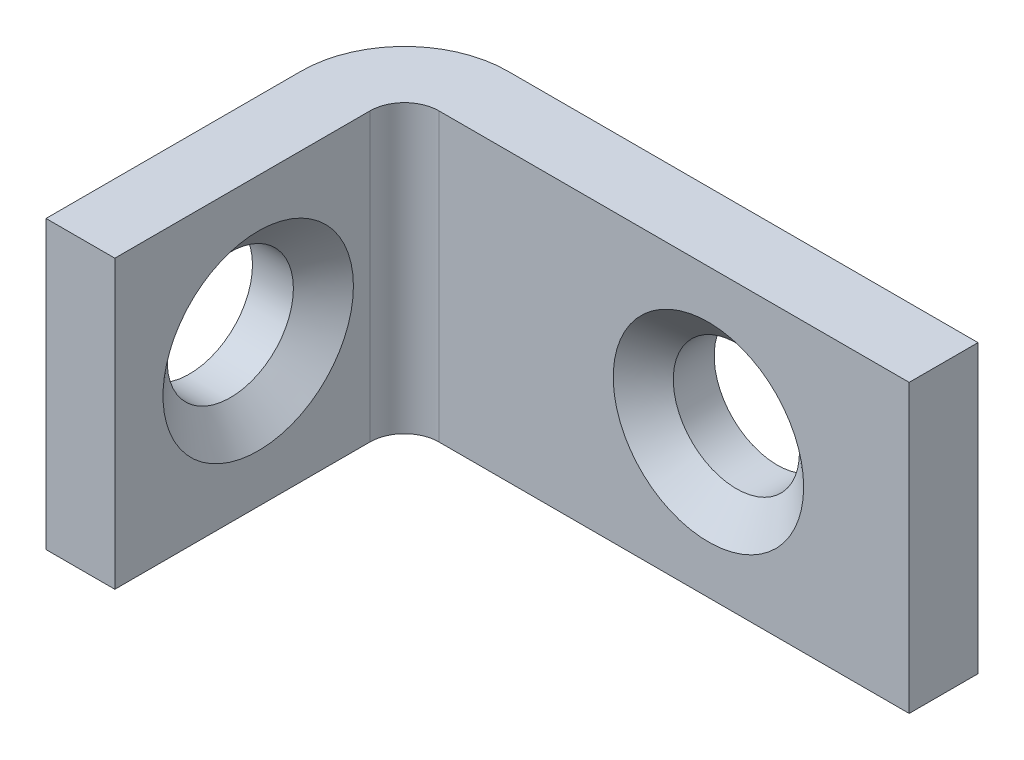
ISO-10303-21;
HEADER;
FILE_DESCRIPTION(('STEP AP214'),'2;1');
FILE_NAME('part.step','',(''),(''),'','','');
FILE_SCHEMA(('AUTOMOTIVE_DESIGN { 1 0 10303 214 1 1 1 1 }'));
ENDSEC;
DATA;
#1=APPLICATION_CONTEXT('core data for automotive mechanical design processes');
#2=APPLICATION_PROTOCOL_DEFINITION('international standard','automotive_design',2000,#1);
#3=PRODUCT_CONTEXT('',#1,'mechanical');
#4=PRODUCT('Part','Part','',(#3));
#5=PRODUCT_RELATED_PRODUCT_CATEGORY('part','',(#4));
#6=PRODUCT_DEFINITION_FORMATION('','',#4);
#7=PRODUCT_DEFINITION_CONTEXT('part definition',#1,'design');
#8=PRODUCT_DEFINITION('design','',#6,#7);
#9=PRODUCT_DEFINITION_SHAPE('','',#8);
#10=(LENGTH_UNIT() NAMED_UNIT(*) SI_UNIT(.MILLI.,.METRE.));
#11=(NAMED_UNIT(*) PLANE_ANGLE_UNIT() SI_UNIT($,.RADIAN.));
#12=(NAMED_UNIT(*) SI_UNIT($,.STERADIAN.) SOLID_ANGLE_UNIT());
#13=UNCERTAINTY_MEASURE_WITH_UNIT(LENGTH_MEASURE(1.E-05),#10,'distance_accuracy_value','');
#14=(GEOMETRIC_REPRESENTATION_CONTEXT(3) GLOBAL_UNCERTAINTY_ASSIGNED_CONTEXT((#13)) GLOBAL_UNIT_ASSIGNED_CONTEXT((#10,
#11,#12)) REPRESENTATION_CONTEXT('',''));
#15=CARTESIAN_POINT('',(0.,0.,0.));
#16=DIRECTION('',(0.,0.,1.));
#17=DIRECTION('',(1.,0.,0.));
#18=AXIS2_PLACEMENT_3D('',#15,#16,#17);
#19=CARTESIAN_POINT('',(4.572,6.35,3.048));
#20=DIRECTION('',(0.,0.,-1.));
#21=DIRECTION('',(-1.,0.,0.));
#22=AXIS2_PLACEMENT_3D('',#19,#20,#21);
#23=PLANE('',#22);
#24=CARTESIAN_POINT('',(16.51,0.,3.048));
#25=DIRECTION('',(0.,0.,1.));
#26=DIRECTION('',(1.,0.,0.));
#27=AXIS2_PLACEMENT_3D('',#24,#25,#26);
#28=CIRCLE('',#27,4.2164);
#29=CARTESIAN_POINT('',(20.7264,0.,3.048));
#30=VERTEX_POINT('',#29);
#31=EDGE_CURVE('E184',#30,#30,#28,.T.);
#32=ORIENTED_EDGE('',*,*,#31,.F.);
#33=EDGE_LOOP('',(#32));
#34=FACE_BOUND('',#33,.T.);
#35=DIRECTION('',(1.,0.,0.));
#36=VECTOR('',#35,1.);
#37=CARTESIAN_POINT('',(4.572,-6.35,3.048));
#38=LINE('',#37,#36);
#39=CARTESIAN_POINT('',(4.572,-6.35,3.048));
#40=VERTEX_POINT('',#39);
#41=CARTESIAN_POINT('',(25.4,-6.35,3.048));
#42=VERTEX_POINT('',#41);
#43=EDGE_CURVE('E145',#40,#42,#38,.T.);
#44=ORIENTED_EDGE('',*,*,#43,.T.);
#45=DIRECTION('',(0.,-1.,0.));
#46=VECTOR('',#45,1.);
#47=CARTESIAN_POINT('',(25.4,6.35,3.048));
#48=LINE('',#47,#46);
#49=CARTESIAN_POINT('',(25.4,6.35,3.048));
#50=VERTEX_POINT('',#49);
#51=EDGE_CURVE('E13',#50,#42,#48,.T.);
#52=ORIENTED_EDGE('',*,*,#51,.F.);
#53=DIRECTION('',(1.,0.,0.));
#54=VECTOR('',#53,1.);
#55=CARTESIAN_POINT('',(4.572,6.35,3.048));
#56=LINE('',#55,#54);
#57=CARTESIAN_POINT('',(4.572,6.35,3.048));
#58=VERTEX_POINT('',#57);
#59=EDGE_CURVE('E103',#58,#50,#56,.T.);
#60=ORIENTED_EDGE('',*,*,#59,.F.);
#61=DIRECTION('',(0.,-1.,0.));
#62=VECTOR('',#61,1.);
#63=CARTESIAN_POINT('',(4.572,6.35,3.048));
#64=LINE('',#63,#62);
#65=EDGE_CURVE('E144',#58,#40,#64,.T.);
#66=ORIENTED_EDGE('',*,*,#65,.T.);
#67=EDGE_LOOP('',(#44,#52,#60,#66));
#68=FACE_BOUND('',#67,.T.);
#69=ADVANCED_FACE('F46',(#34,#68),#23,.F.);
#70=CARTESIAN_POINT('',(4.572,6.35,0.));
#71=DIRECTION('',(0.,0.,-1.));
#72=DIRECTION('',(-1.,0.,0.));
#73=AXIS2_PLACEMENT_3D('',#70,#71,#72);
#74=PLANE('',#73);
#75=DIRECTION('',(1.,0.,0.));
#76=VECTOR('',#75,1.);
#77=CARTESIAN_POINT('',(4.572,-6.35,0.));
#78=LINE('',#77,#76);
#79=CARTESIAN_POINT('',(4.572,-6.35,0.));
#80=VERTEX_POINT('',#79);
#81=CARTESIAN_POINT('',(25.4,-6.35,0.));
#82=VERTEX_POINT('',#81);
#83=EDGE_CURVE('E152',#80,#82,#78,.T.);
#84=ORIENTED_EDGE('',*,*,#83,.F.);
#85=DIRECTION('',(0.,-1.,0.));
#86=VECTOR('',#85,1.);
#87=CARTESIAN_POINT('',(4.572,6.35,0.));
#88=LINE('',#87,#86);
#89=CARTESIAN_POINT('',(4.572,6.35,0.));
#90=VERTEX_POINT('',#89);
#91=EDGE_CURVE('E169',#90,#80,#88,.T.);
#92=ORIENTED_EDGE('',*,*,#91,.F.);
#93=DIRECTION('',(1.,0.,0.));
#94=VECTOR('',#93,1.);
#95=CARTESIAN_POINT('',(4.572,6.35,0.));
#96=LINE('',#95,#94);
#97=CARTESIAN_POINT('',(25.4,6.35,0.));
#98=VERTEX_POINT('',#97);
#99=EDGE_CURVE('E193',#90,#98,#96,.T.);
#100=ORIENTED_EDGE('',*,*,#99,.T.);
#101=DIRECTION('',(0.,-1.,0.));
#102=VECTOR('',#101,1.);
#103=CARTESIAN_POINT('',(25.4,6.35,0.));
#104=LINE('',#103,#102);
#105=EDGE_CURVE('E55',#98,#82,#104,.T.);
#106=ORIENTED_EDGE('',*,*,#105,.T.);
#107=EDGE_LOOP('',(#84,#92,#100,#106));
#108=FACE_BOUND('',#107,.T.);
#109=CARTESIAN_POINT('',(16.51,0.,0.));
#110=DIRECTION('',(0.,0.,1.));
#111=DIRECTION('',(1.,0.,0.));
#112=AXIS2_PLACEMENT_3D('',#109,#110,#111);
#113=CIRCLE('',#112,2.794);
#114=CARTESIAN_POINT('',(19.304,0.,0.));
#115=VERTEX_POINT('',#114);
#116=EDGE_CURVE('E173',#115,#115,#113,.T.);
#117=ORIENTED_EDGE('',*,*,#116,.T.);
#118=EDGE_LOOP('',(#117));
#119=FACE_BOUND('',#118,.T.);
#120=ADVANCED_FACE('F221',(#108,#119),#74,.T.);
#121=CARTESIAN_POINT('',(25.4,6.35,0.));
#122=DIRECTION('',(1.,0.,0.));
#123=DIRECTION('',(0.,0.,-1.));
#124=AXIS2_PLACEMENT_3D('',#121,#122,#123);
#125=PLANE('',#124);
#126=DIRECTION('',(0.,0.,1.));
#127=VECTOR('',#126,1.);
#128=CARTESIAN_POINT('',(25.4,-6.35,0.));
#129=LINE('',#128,#127);
#130=EDGE_CURVE('E148',#82,#42,#129,.T.);
#131=ORIENTED_EDGE('',*,*,#130,.F.);
#132=ORIENTED_EDGE('',*,*,#105,.F.);
#133=DIRECTION('',(0.,0.,1.));
#134=VECTOR('',#133,1.);
#135=CARTESIAN_POINT('',(25.4,6.35,0.));
#136=LINE('',#135,#134);
#137=EDGE_CURVE('E190',#98,#50,#136,.T.);
#138=ORIENTED_EDGE('',*,*,#137,.T.);
#139=ORIENTED_EDGE('',*,*,#51,.T.);
#140=EDGE_LOOP('',(#131,#132,#138,#139));
#141=FACE_BOUND('',#140,.T.);
#142=ADVANCED_FACE('F226',(#141),#125,.T.);
#143=CARTESIAN_POINT('',(4.572,6.35,4.572));
#144=DIRECTION('',(0.,-1.,0.));
#145=DIRECTION('',(0.,0.,-1.));
#146=AXIS2_PLACEMENT_3D('',#143,#144,#145);
#147=CYLINDRICAL_SURFACE('',#146,4.572);
#148=CARTESIAN_POINT('',(4.572,-6.35,4.572));
#149=DIRECTION('',(0.,-1.,0.));
#150=DIRECTION('',(0.,0.,1.));
#151=AXIS2_PLACEMENT_3D('',#148,#149,#150);
#152=CIRCLE('',#151,4.572);
#153=CARTESIAN_POINT('',(0.,-6.35,4.572));
#154=VERTEX_POINT('',#153);
#155=EDGE_CURVE('E155',#154,#80,#152,.T.);
#156=ORIENTED_EDGE('',*,*,#155,.F.);
#157=DIRECTION('',(0.,-1.,0.));
#158=VECTOR('',#157,1.);
#159=CARTESIAN_POINT('',(0.,6.35,4.572));
#160=LINE('',#159,#158);
#161=CARTESIAN_POINT('',(0.,6.35,4.572));
#162=VERTEX_POINT('',#161);
#163=EDGE_CURVE('E167',#162,#154,#160,.T.);
#164=ORIENTED_EDGE('',*,*,#163,.F.);
#165=CARTESIAN_POINT('',(4.572,6.35,4.572));
#166=DIRECTION('',(0.,-1.,0.));
#167=DIRECTION('',(0.,0.,1.));
#168=AXIS2_PLACEMENT_3D('',#165,#166,#167);
#169=CIRCLE('',#168,4.572);
#170=EDGE_CURVE('E139',#162,#90,#169,.T.);
#171=ORIENTED_EDGE('',*,*,#170,.T.);
#172=ORIENTED_EDGE('',*,*,#91,.T.);
#173=EDGE_LOOP('',(#156,#164,#171,#172));
#174=FACE_BOUND('',#173,.T.);
#175=ADVANCED_FACE('F198',(#174),#147,.T.);
#176=CARTESIAN_POINT('',(0.,6.35,15.875));
#177=DIRECTION('',(-1.,0.,0.));
#178=DIRECTION('',(0.,0.,1.));
#179=AXIS2_PLACEMENT_3D('',#176,#177,#178);
#180=PLANE('',#179);
#181=CARTESIAN_POINT('',(0.,0.,9.525));
#182=DIRECTION('',(1.,0.,0.));
#183=DIRECTION('',(0.,0.,-1.));
#184=AXIS2_PLACEMENT_3D('',#181,#182,#183);
#185=CIRCLE('',#184,2.794);
#186=CARTESIAN_POINT('',(0.,0.,6.731));
#187=VERTEX_POINT('',#186);
#188=EDGE_CURVE('E149',#187,#187,#185,.T.);
#189=ORIENTED_EDGE('',*,*,#188,.T.);
#190=EDGE_LOOP('',(#189));
#191=FACE_BOUND('',#190,.T.);
#192=DIRECTION('',(0.,0.,-1.));
#193=VECTOR('',#192,1.);
#194=CARTESIAN_POINT('',(0.,-6.35,15.875));
#195=LINE('',#194,#193);
#196=CARTESIAN_POINT('',(0.,-6.35,15.875));
#197=VERTEX_POINT('',#196);
#198=EDGE_CURVE('E158',#197,#154,#195,.T.);
#199=ORIENTED_EDGE('',*,*,#198,.F.);
#200=DIRECTION('',(0.,-1.,0.));
#201=VECTOR('',#200,1.);
#202=CARTESIAN_POINT('',(0.,6.35,15.875));
#203=LINE('',#202,#201);
#204=CARTESIAN_POINT('',(0.,6.35,15.875));
#205=VERTEX_POINT('',#204);
#206=EDGE_CURVE('E127',#205,#197,#203,.T.);
#207=ORIENTED_EDGE('',*,*,#206,.F.);
#208=DIRECTION('',(0.,0.,-1.));
#209=VECTOR('',#208,1.);
#210=CARTESIAN_POINT('',(0.,6.35,15.875));
#211=LINE('',#210,#209);
#212=EDGE_CURVE('E137',#205,#162,#211,.T.);
#213=ORIENTED_EDGE('',*,*,#212,.T.);
#214=ORIENTED_EDGE('',*,*,#163,.T.);
#215=EDGE_LOOP('',(#199,#207,#213,#214));
#216=FACE_BOUND('',#215,.T.);
#217=ADVANCED_FACE('F203',(#191,#216),#180,.T.);
#218=CARTESIAN_POINT('',(3.048,6.35,15.875));
#219=DIRECTION('',(0.,0.,1.));
#220=DIRECTION('',(1.,0.,0.));
#221=AXIS2_PLACEMENT_3D('',#218,#219,#220);
#222=PLANE('',#221);
#223=DIRECTION('',(-1.,0.,0.));
#224=VECTOR('',#223,1.);
#225=CARTESIAN_POINT('',(3.048,-6.35,15.875));
#226=LINE('',#225,#224);
#227=CARTESIAN_POINT('',(3.048,-6.35,15.875));
#228=VERTEX_POINT('',#227);
#229=EDGE_CURVE('E126',#228,#197,#226,.T.);
#230=ORIENTED_EDGE('',*,*,#229,.F.);
#231=DIRECTION('',(0.,-1.,0.));
#232=VECTOR('',#231,1.);
#233=CARTESIAN_POINT('',(3.048,6.35,15.875));
#234=LINE('',#233,#232);
#235=CARTESIAN_POINT('',(3.048,6.35,15.875));
#236=VERTEX_POINT('',#235);
#237=EDGE_CURVE('E120',#236,#228,#234,.T.);
#238=ORIENTED_EDGE('',*,*,#237,.F.);
#239=DIRECTION('',(-1.,0.,0.));
#240=VECTOR('',#239,1.);
#241=CARTESIAN_POINT('',(3.048,6.35,15.875));
#242=LINE('',#241,#240);
#243=EDGE_CURVE('E124',#236,#205,#242,.T.);
#244=ORIENTED_EDGE('',*,*,#243,.T.);
#245=ORIENTED_EDGE('',*,*,#206,.T.);
#246=EDGE_LOOP('',(#230,#238,#244,#245));
#247=FACE_BOUND('',#246,.T.);
#248=ADVANCED_FACE('F122',(#247),#222,.T.);
#249=CARTESIAN_POINT('',(3.048,6.35,15.875));
#250=DIRECTION('',(-1.,0.,0.));
#251=DIRECTION('',(0.,0.,1.));
#252=AXIS2_PLACEMENT_3D('',#249,#250,#251);
#253=PLANE('',#252);
#254=CARTESIAN_POINT('',(3.048,0.,9.525));
#255=DIRECTION('',(1.,0.,0.));
#256=DIRECTION('',(0.,0.,-1.));
#257=AXIS2_PLACEMENT_3D('',#254,#255,#256);
#258=CIRCLE('',#257,4.2164);
#259=CARTESIAN_POINT('',(3.048,0.,5.3086));
#260=VERTEX_POINT('',#259);
#261=EDGE_CURVE('E174',#260,#260,#258,.T.);
#262=ORIENTED_EDGE('',*,*,#261,.F.);
#263=EDGE_LOOP('',(#262));
#264=FACE_BOUND('',#263,.T.);
#265=DIRECTION('',(0.,0.,-1.));
#266=VECTOR('',#265,1.);
#267=CARTESIAN_POINT('',(3.048,-6.35,15.875));
#268=LINE('',#267,#266);
#269=CARTESIAN_POINT('',(3.048,-6.35,4.572));
#270=VERTEX_POINT('',#269);
#271=EDGE_CURVE('E91',#228,#270,#268,.T.);
#272=ORIENTED_EDGE('',*,*,#271,.T.);
#273=DIRECTION('',(0.,-1.,0.));
#274=VECTOR('',#273,1.);
#275=CARTESIAN_POINT('',(3.048,6.35,4.572));
#276=LINE('',#275,#274);
#277=CARTESIAN_POINT('',(3.048,6.35,4.572));
#278=VERTEX_POINT('',#277);
#279=EDGE_CURVE('E128',#278,#270,#276,.T.);
#280=ORIENTED_EDGE('',*,*,#279,.F.);
#281=DIRECTION('',(0.,0.,-1.));
#282=VECTOR('',#281,1.);
#283=CARTESIAN_POINT('',(3.048,6.35,15.875));
#284=LINE('',#283,#282);
#285=EDGE_CURVE('E130',#236,#278,#284,.T.);
#286=ORIENTED_EDGE('',*,*,#285,.F.);
#287=ORIENTED_EDGE('',*,*,#237,.T.);
#288=EDGE_LOOP('',(#272,#280,#286,#287));
#289=FACE_BOUND('',#288,.T.);
#290=ADVANCED_FACE('F131',(#264,#289),#253,.F.);
#291=CARTESIAN_POINT('',(4.572,6.35,4.572));
#292=DIRECTION('',(0.,-1.,0.));
#293=DIRECTION('',(0.,0.,-1.));
#294=AXIS2_PLACEMENT_3D('',#291,#292,#293);
#295=CYLINDRICAL_SURFACE('',#294,1.524);
#296=CARTESIAN_POINT('',(4.572,-6.35,4.572));
#297=DIRECTION('',(0.,1.,0.));
#298=DIRECTION('',(1.,0.,0.));
#299=AXIS2_PLACEMENT_3D('',#296,#297,#298);
#300=CIRCLE('',#299,1.524);
#301=EDGE_CURVE('E97',#270,#40,#300,.F.);
#302=ORIENTED_EDGE('',*,*,#301,.T.);
#303=ORIENTED_EDGE('',*,*,#65,.F.);
#304=CARTESIAN_POINT('',(4.572,6.35,4.572));
#305=DIRECTION('',(0.,1.,0.));
#306=DIRECTION('',(1.,0.,0.));
#307=AXIS2_PLACEMENT_3D('',#304,#305,#306);
#308=CIRCLE('',#307,1.524);
#309=EDGE_CURVE('E64',#278,#58,#308,.F.);
#310=ORIENTED_EDGE('',*,*,#309,.F.);
#311=ORIENTED_EDGE('',*,*,#279,.T.);
#312=EDGE_LOOP('',(#302,#303,#310,#311));
#313=FACE_BOUND('',#312,.T.);
#314=ADVANCED_FACE('F209',(#313),#295,.F.);
#315=CARTESIAN_POINT('',(4.572,6.35,4.572));
#316=DIRECTION('',(0.,-1.,0.));
#317=DIRECTION('',(-1.,0.,0.));
#318=AXIS2_PLACEMENT_3D('',#315,#316,#317);
#319=PLANE('',#318);
#320=ORIENTED_EDGE('',*,*,#59,.T.);
#321=ORIENTED_EDGE('',*,*,#137,.F.);
#322=ORIENTED_EDGE('',*,*,#99,.F.);
#323=ORIENTED_EDGE('',*,*,#170,.F.);
#324=ORIENTED_EDGE('',*,*,#212,.F.);
#325=ORIENTED_EDGE('',*,*,#243,.F.);
#326=ORIENTED_EDGE('',*,*,#285,.T.);
#327=ORIENTED_EDGE('',*,*,#309,.T.);
#328=EDGE_LOOP('',(#320,#321,#322,#323,#324,#325,#326,#327));
#329=FACE_BOUND('',#328,.T.);
#330=ADVANCED_FACE('F134',(#329),#319,.F.);
#331=CARTESIAN_POINT('',(4.572,-6.35,4.572));
#332=DIRECTION('',(0.,-1.,0.));
#333=DIRECTION('',(-1.,0.,0.));
#334=AXIS2_PLACEMENT_3D('',#331,#332,#333);
#335=PLANE('',#334);
#336=ORIENTED_EDGE('',*,*,#43,.F.);
#337=ORIENTED_EDGE('',*,*,#301,.F.);
#338=ORIENTED_EDGE('',*,*,#271,.F.);
#339=ORIENTED_EDGE('',*,*,#229,.T.);
#340=ORIENTED_EDGE('',*,*,#198,.T.);
#341=ORIENTED_EDGE('',*,*,#155,.T.);
#342=ORIENTED_EDGE('',*,*,#83,.T.);
#343=ORIENTED_EDGE('',*,*,#130,.T.);
#344=EDGE_LOOP('',(#336,#337,#338,#339,#340,#341,#342,#343));
#345=FACE_BOUND('',#344,.T.);
#346=ADVANCED_FACE('F206',(#345),#335,.T.);
#347=CARTESIAN_POINT('',(0.,0.,9.525));
#348=DIRECTION('',(1.,0.,0.));
#349=DIRECTION('',(0.,0.,-1.));
#350=AXIS2_PLACEMENT_3D('',#347,#348,#349);
#351=CYLINDRICAL_SURFACE('',#350,2.794);
#352=CARTESIAN_POINT('',(1.8115265441302,0.,9.525));
#353=DIRECTION('',(1.,0.,0.));
#354=DIRECTION('',(0.,0.,-1.));
#355=AXIS2_PLACEMENT_3D('',#352,#353,#354);
#356=CIRCLE('',#355,2.794);
#357=CARTESIAN_POINT('',(1.8115265441302,0.,6.731));
#358=VERTEX_POINT('',#357);
#359=EDGE_CURVE('E171',#358,#358,#356,.T.);
#360=CARTESIAN_POINT('',(1.8115265441302,0.,6.731));
#361=CARTESIAN_POINT('',(1.79265647596218,0.,6.731));
#362=CARTESIAN_POINT('',(1.77378640779416,0.,6.731));
#363=CARTESIAN_POINT('',(1.73604627145811,0.,6.731));
#364=CARTESIAN_POINT('',(1.71717620329009,0.,6.731));
#365=CARTESIAN_POINT('',(1.67943606695404,0.,6.731));
#366=CARTESIAN_POINT('',(1.66056599878602,0.,6.731));
#367=CARTESIAN_POINT('',(1.62282586244997,0.,6.731));
#368=CARTESIAN_POINT('',(1.60395579428195,0.,6.731));
#369=CARTESIAN_POINT('',(1.56621565794591,0.,6.731));
#370=CARTESIAN_POINT('',(1.54734558977788,0.,6.731));
#371=CARTESIAN_POINT('',(1.50960545344184,0.,6.731));
#372=CARTESIAN_POINT('',(1.49073538527381,0.,6.731));
#373=CARTESIAN_POINT('',(1.45299524893777,0.,6.731));
#374=CARTESIAN_POINT('',(1.43412518076974,0.,6.731));
#375=CARTESIAN_POINT('',(1.3963850444337,0.,6.731));
#376=CARTESIAN_POINT('',(1.37751497626568,0.,6.731));
#377=CARTESIAN_POINT('',(1.33977483992963,0.,6.731));
#378=CARTESIAN_POINT('',(1.32090477176161,0.,6.731));
#379=CARTESIAN_POINT('',(1.28316463542556,0.,6.731));
#380=CARTESIAN_POINT('',(1.26429456725754,0.,6.731));
#381=CARTESIAN_POINT('',(1.22655443092149,0.,6.731));
#382=CARTESIAN_POINT('',(1.20768436275347,0.,6.731));
#383=CARTESIAN_POINT('',(1.16994422641742,0.,6.731));
#384=CARTESIAN_POINT('',(1.1510741582494,0.,6.731));
#385=CARTESIAN_POINT('',(1.11333402191335,0.,6.731));
#386=CARTESIAN_POINT('',(1.09446395374533,0.,6.731));
#387=CARTESIAN_POINT('',(1.05672381740929,0.,6.731));
#388=CARTESIAN_POINT('',(1.03785374924126,0.,6.731));
#389=CARTESIAN_POINT('',(1.00011361290522,0.,6.731));
#390=CARTESIAN_POINT('',(0.981243544737193,0.,6.731));
#391=CARTESIAN_POINT('',(0.943503408401148,0.,6.731));
#392=CARTESIAN_POINT('',(0.924633340233125,0.,6.731));
#393=CARTESIAN_POINT('',(0.886893203897079,0.,6.731));
#394=CARTESIAN_POINT('',(0.868023135729056,0.,6.731));
#395=CARTESIAN_POINT('',(0.83028299939301,0.,6.731));
#396=CARTESIAN_POINT('',(0.811412931224987,0.,6.731));
#397=CARTESIAN_POINT('',(0.773672794888941,0.,6.731));
#398=CARTESIAN_POINT('',(0.754802726720918,0.,6.731));
#399=CARTESIAN_POINT('',(0.717062590384872,0.,6.731));
#400=CARTESIAN_POINT('',(0.698192522216849,0.,6.731));
#401=CARTESIAN_POINT('',(0.660452385880803,0.,6.731));
#402=CARTESIAN_POINT('',(0.64158231771278,0.,6.731));
#403=CARTESIAN_POINT('',(0.603842181376734,0.,6.731));
#404=CARTESIAN_POINT('',(0.584972113208711,0.,6.731));
#405=CARTESIAN_POINT('',(0.547231976872665,0.,6.731));
#406=CARTESIAN_POINT('',(0.528361908704643,0.,6.731));
#407=CARTESIAN_POINT('',(0.490621772368596,0.,6.731));
#408=CARTESIAN_POINT('',(0.471751704200573,0.,6.731));
#409=CARTESIAN_POINT('',(0.434011567864528,0.,6.731));
#410=CARTESIAN_POINT('',(0.415141499696505,0.,6.731));
#411=CARTESIAN_POINT('',(0.377401363360459,0.,6.731));
#412=CARTESIAN_POINT('',(0.358531295192436,0.,6.731));
#413=CARTESIAN_POINT('',(0.32079115885639,0.,6.731));
#414=CARTESIAN_POINT('',(0.301921090688367,0.,6.731));
#415=CARTESIAN_POINT('',(0.264180954352321,0.,6.731));
#416=CARTESIAN_POINT('',(0.245310886184298,0.,6.731));
#417=CARTESIAN_POINT('',(0.207570749848252,0.,6.731));
#418=CARTESIAN_POINT('',(0.188700681680229,0.,6.731));
#419=CARTESIAN_POINT('',(0.150960545344183,0.,6.731));
#420=CARTESIAN_POINT('',(0.13209047717616,0.,6.731));
#421=CARTESIAN_POINT('',(0.0943503408401145,0.,6.731));
#422=CARTESIAN_POINT('',(0.0754802726720916,0.,6.731));
#423=CARTESIAN_POINT('',(0.0377401363360457,0.,6.731));
#424=CARTESIAN_POINT('',(0.0188700681680227,0.,6.731));
#425=CARTESIAN_POINT('',(0.,0.,6.731));
#426=B_SPLINE_CURVE_WITH_KNOTS('',3,(#360,#361,#362,#363,#364,#365,#366,#367,#368,#369,#370,
#371,#372,#373,#374,#375,#376,#377,#378,#379,#380,#381,#382,#383,#384,#385,#386,#387,#388,#389,
#390,#391,#392,#393,#394,#395,#396,#397,#398,#399,#400,#401,#402,#403,#404,#405,#406,#407,#408,
#409,#410,#411,#412,#413,#414,#415,#416,#417,#418,#419,#420,#421,#422,#423,#424,#425),
.UNSPECIFIED.,.F.,.F.,(4,2,2,2,2,2,2,2,2,2,2,2,2,2,2,2,2,2,2,2,2,2,2,2,2,2,2,2,2,2,2,2,4),(0.,
0.056610204504069,0.113220409008138,0.169830613512207,0.226440818016275,0.283051022520344,
0.339661227024413,0.396271431528482,0.452881636032551,0.50949184053662,0.566102045040689,
0.622712249544758,0.679322454048827,0.735932658552895,0.792542863056964,0.849153067561033,
0.905763272065102,0.962373476569171,1.01898368107324,1.07559388557731,1.13220409008138,
1.18881429458545,1.24542449908952,1.30203470359358,1.35864490809765,1.41525511260172,
1.47186531710579,1.52847552160986,1.58508572611393,1.641695930618,1.69830613512207,
1.75491633962613,1.8115265441302),.UNSPECIFIED.);
#427=EDGE_CURVE('BSEAM245',#358,#187,#426,.T.);
#428=ORIENTED_EDGE('',*,*,#359,.T.);
#429=ORIENTED_EDGE('',*,*,#188,.F.);
#430=ORIENTED_EDGE('',*,*,#427,.T.);
#431=ORIENTED_EDGE('',*,*,#427,.F.);
#432=EDGE_LOOP('',(#428,#430,#429,#431));
#433=FACE_BOUND('',#432,.T.);
#434=ADVANCED_FACE('F245',(#433),#351,.F.);
#435=CARTESIAN_POINT('',(16.51,0.,15.875));
#436=DIRECTION('',(0.,0.,-1.));
#437=DIRECTION('',(-1.,0.,0.));
#438=AXIS2_PLACEMENT_3D('',#435,#436,#437);
#439=CYLINDRICAL_SURFACE('',#438,2.794);
#440=CARTESIAN_POINT('',(16.51,0.,1.81152654413021));
#441=DIRECTION('',(0.,0.,1.));
#442=DIRECTION('',(1.,0.,0.));
#443=AXIS2_PLACEMENT_3D('',#440,#441,#442);
#444=CIRCLE('',#443,2.794);
#445=CARTESIAN_POINT('',(19.304,0.,1.81152654413021));
#446=VERTEX_POINT('',#445);
#447=EDGE_CURVE('E49',#446,#446,#444,.F.);
#448=ORIENTED_EDGE('',*,*,#447,.F.);
#449=EDGE_LOOP('',(#448));
#450=FACE_BOUND('',#449,.T.);
#451=ORIENTED_EDGE('',*,*,#116,.F.);
#452=EDGE_LOOP('',(#451));
#453=FACE_BOUND('',#452,.T.);
#454=ADVANCED_FACE('F240',(#450,#453),#439,.F.);
#455=CARTESIAN_POINT('',(3.048,0.,9.525));
#456=DIRECTION('',(1.,0.,0.));
#457=DIRECTION('',(0.,0.,-1.));
#458=AXIS2_PLACEMENT_3D('',#455,#456,#457);
#459=CONICAL_SURFACE('',#458,4.2164,0.855211333477223);
#460=ORIENTED_EDGE('',*,*,#261,.T.);
#461=EDGE_LOOP('',(#460));
#462=FACE_BOUND('',#461,.T.);
#463=ORIENTED_EDGE('',*,*,#359,.F.);
#464=EDGE_LOOP('',(#463));
#465=FACE_BOUND('',#464,.T.);
#466=ADVANCED_FACE('F234',(#462,#465),#459,.F.);
#467=CARTESIAN_POINT('',(16.51,0.,3.048));
#468=DIRECTION('',(0.,0.,1.));
#469=DIRECTION('',(1.,0.,0.));
#470=AXIS2_PLACEMENT_3D('',#467,#468,#469);
#471=CONICAL_SURFACE('',#470,4.2164,0.855211333477223);
#472=ORIENTED_EDGE('',*,*,#447,.T.);
#473=EDGE_LOOP('',(#472));
#474=FACE_BOUND('',#473,.T.);
#475=ORIENTED_EDGE('',*,*,#31,.T.);
#476=EDGE_LOOP('',(#475));
#477=FACE_BOUND('',#476,.T.);
#478=ADVANCED_FACE('F232',(#474,#477),#471,.F.);
#479=CLOSED_SHELL('',(#69,#120,#142,#175,#217,#248,#290,#314,#330,#346,#434,#454,#466,#478));
#480=MANIFOLD_SOLID_BREP('B2',#479);
#481=ADVANCED_BREP_SHAPE_REPRESENTATION('',(#18,#480),#14);
#482=SHAPE_DEFINITION_REPRESENTATION(#9,#481);
ENDSEC;
END-ISO-10303-21;
